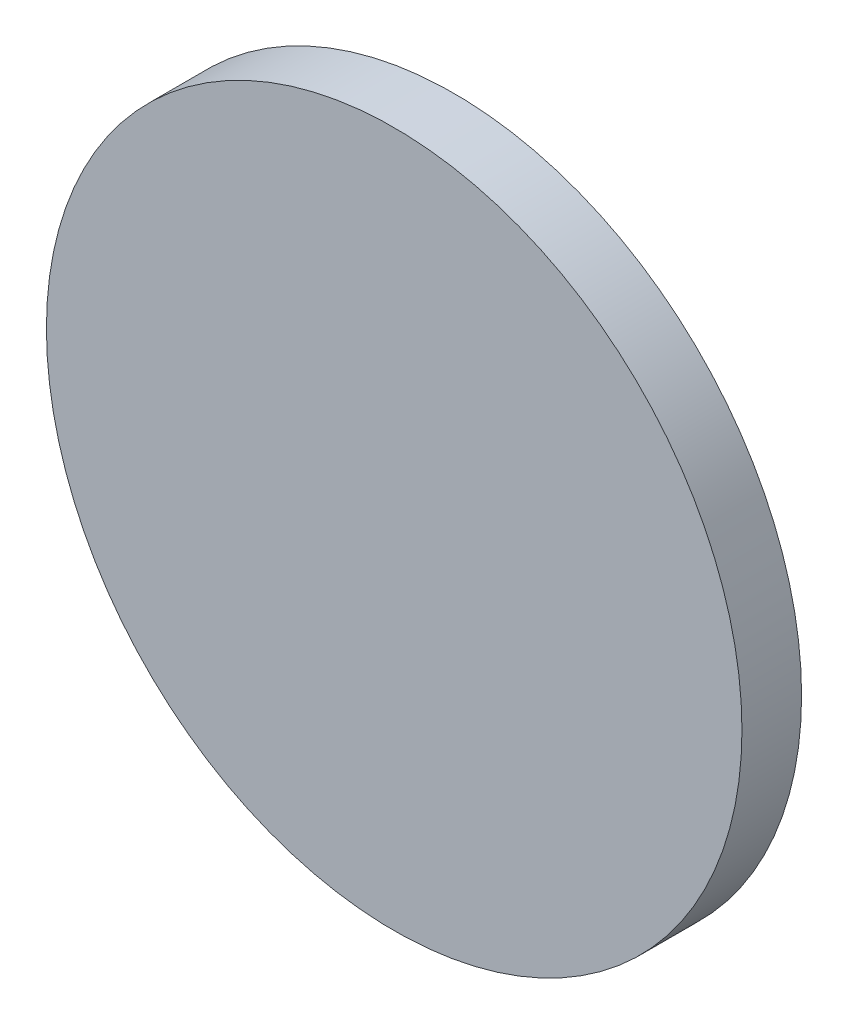
ISO-10303-21;
HEADER;
FILE_DESCRIPTION(('STEP AP214'),'2;1');
FILE_NAME('part.step','',(''),(''),'','','');
FILE_SCHEMA(('AUTOMOTIVE_DESIGN { 1 0 10303 214 1 1 1 1 }'));
ENDSEC;
DATA;
#1=APPLICATION_CONTEXT('core data for automotive mechanical design processes');
#2=APPLICATION_PROTOCOL_DEFINITION('international standard','automotive_design',2000,#1);
#3=PRODUCT_CONTEXT('',#1,'mechanical');
#4=PRODUCT('Part','Part','',(#3));
#5=PRODUCT_RELATED_PRODUCT_CATEGORY('part','',(#4));
#6=PRODUCT_DEFINITION_FORMATION('','',#4);
#7=PRODUCT_DEFINITION_CONTEXT('part definition',#1,'design');
#8=PRODUCT_DEFINITION('design','',#6,#7);
#9=PRODUCT_DEFINITION_SHAPE('','',#8);
#10=(LENGTH_UNIT() NAMED_UNIT(*) SI_UNIT(.MILLI.,.METRE.));
#11=(NAMED_UNIT(*) PLANE_ANGLE_UNIT() SI_UNIT($,.RADIAN.));
#12=(NAMED_UNIT(*) SI_UNIT($,.STERADIAN.) SOLID_ANGLE_UNIT());
#13=UNCERTAINTY_MEASURE_WITH_UNIT(LENGTH_MEASURE(1.E-05),#10,'distance_accuracy_value','');
#14=(GEOMETRIC_REPRESENTATION_CONTEXT(3) GLOBAL_UNCERTAINTY_ASSIGNED_CONTEXT((#13)) GLOBAL_UNIT_ASSIGNED_CONTEXT((#10,
#11,#12)) REPRESENTATION_CONTEXT('',''));
#15=CARTESIAN_POINT('',(0.,0.,0.));
#16=DIRECTION('',(0.,0.,1.));
#17=DIRECTION('',(1.,0.,0.));
#18=AXIS2_PLACEMENT_3D('',#15,#16,#17);
#19=CARTESIAN_POINT('',(7.325,9.375,0.));
#20=DIRECTION('',(0.,0.,-1.));
#21=DIRECTION('',(-1.,0.,0.));
#22=AXIS2_PLACEMENT_3D('',#19,#20,#21);
#23=PLANE('',#22);
#24=CARTESIAN_POINT('',(7.325,9.375,0.));
#25=DIRECTION('',(0.,0.,1.));
#26=DIRECTION('',(1.,0.,0.));
#27=AXIS2_PLACEMENT_3D('',#24,#25,#26);
#28=CIRCLE('',#27,0.200024667);
#29=CARTESIAN_POINT('',(7.525024667,9.375,0.));
#30=VERTEX_POINT('',#29);
#31=EDGE_CURVE('E18',#30,#30,#28,.T.);
#32=ORIENTED_EDGE('',*,*,#31,.F.);
#33=EDGE_LOOP('',(#32));
#34=FACE_BOUND('',#33,.T.);
#35=ADVANCED_FACE('F15',(#34),#23,.T.);
#36=CARTESIAN_POINT('',(7.325,9.375,0.));
#37=DIRECTION('',(0.,0.,1.));
#38=DIRECTION('',(1.,0.,0.));
#39=AXIS2_PLACEMENT_3D('',#36,#37,#38);
#40=CYLINDRICAL_SURFACE('',#39,0.200024667);
#41=CARTESIAN_POINT('',(7.325,9.375,0.03429));
#42=DIRECTION('',(0.,0.,1.));
#43=DIRECTION('',(1.,0.,0.));
#44=AXIS2_PLACEMENT_3D('',#41,#42,#43);
#45=CIRCLE('',#44,0.200024667);
#46=CARTESIAN_POINT('',(7.525024667,9.375,0.03429));
#47=VERTEX_POINT('',#46);
#48=EDGE_CURVE('E10',#47,#47,#45,.T.);
#49=ORIENTED_EDGE('',*,*,#48,.F.);
#50=EDGE_LOOP('',(#49));
#51=FACE_BOUND('',#50,.T.);
#52=ORIENTED_EDGE('',*,*,#31,.T.);
#53=EDGE_LOOP('',(#52));
#54=FACE_BOUND('',#53,.T.);
#55=ADVANCED_FACE('F27',(#51,#54),#40,.T.);
#56=CARTESIAN_POINT('',(7.325,9.375,0.03429));
#57=DIRECTION('',(0.,0.,1.));
#58=DIRECTION('',(1.,0.,0.));
#59=AXIS2_PLACEMENT_3D('',#56,#57,#58);
#60=PLANE('',#59);
#61=ORIENTED_EDGE('',*,*,#48,.T.);
#62=EDGE_LOOP('',(#61));
#63=FACE_BOUND('',#62,.T.);
#64=ADVANCED_FACE('F34',(#63),#60,.T.);
#65=CLOSED_SHELL('',(#35,#55,#64));
#66=MANIFOLD_SOLID_BREP('B1',#65);
#67=ADVANCED_BREP_SHAPE_REPRESENTATION('',(#18,#66),#14);
#68=SHAPE_DEFINITION_REPRESENTATION(#9,#67);
ENDSEC;
END-ISO-10303-21;
